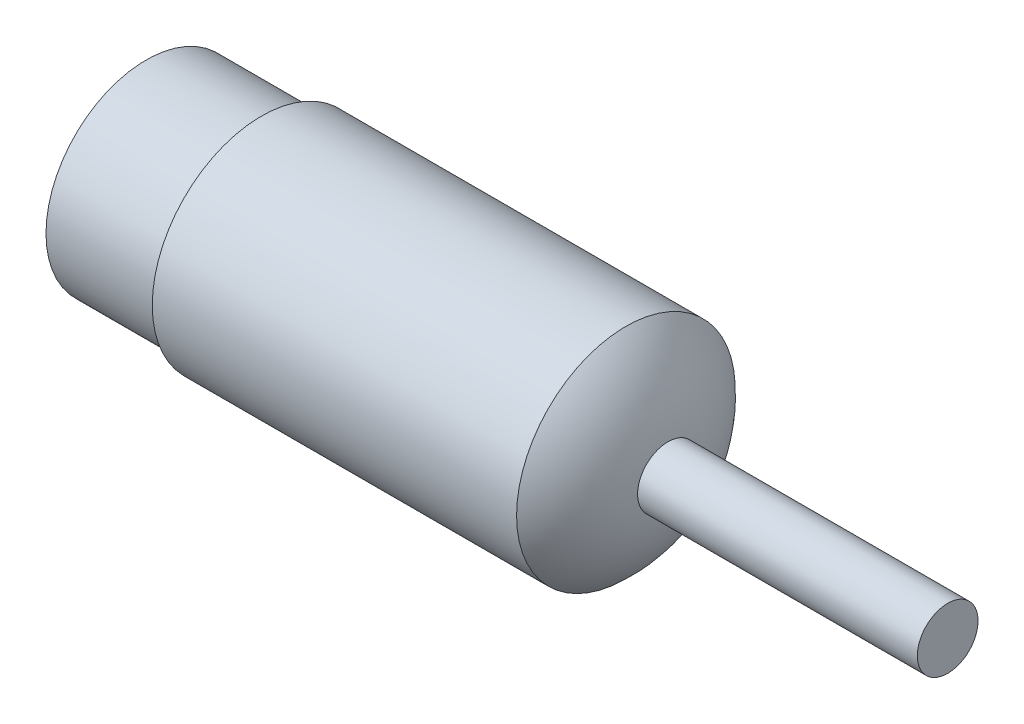
ISO-10303-21;
HEADER;
FILE_DESCRIPTION(('STEP AP214'),'2;1');
FILE_NAME('part.step','',(''),(''),'','','');
FILE_SCHEMA(('AUTOMOTIVE_DESIGN { 1 0 10303 214 1 1 1 1 }'));
ENDSEC;
DATA;
#1=APPLICATION_CONTEXT('core data for automotive mechanical design processes');
#2=APPLICATION_PROTOCOL_DEFINITION('international standard','automotive_design',2000,#1);
#3=PRODUCT_CONTEXT('',#1,'mechanical');
#4=PRODUCT('Part','Part','',(#3));
#5=PRODUCT_RELATED_PRODUCT_CATEGORY('part','',(#4));
#6=PRODUCT_DEFINITION_FORMATION('','',#4);
#7=PRODUCT_DEFINITION_CONTEXT('part definition',#1,'design');
#8=PRODUCT_DEFINITION('design','',#6,#7);
#9=PRODUCT_DEFINITION_SHAPE('','',#8);
#10=(LENGTH_UNIT() NAMED_UNIT(*) SI_UNIT(.MILLI.,.METRE.));
#11=(NAMED_UNIT(*) PLANE_ANGLE_UNIT() SI_UNIT($,.RADIAN.));
#12=(NAMED_UNIT(*) SI_UNIT($,.STERADIAN.) SOLID_ANGLE_UNIT());
#13=UNCERTAINTY_MEASURE_WITH_UNIT(LENGTH_MEASURE(1.E-05),#10,'distance_accuracy_value','');
#14=(GEOMETRIC_REPRESENTATION_CONTEXT(3) GLOBAL_UNCERTAINTY_ASSIGNED_CONTEXT((#13)) GLOBAL_UNIT_ASSIGNED_CONTEXT((#10,
#11,#12)) REPRESENTATION_CONTEXT('',''));
#15=CARTESIAN_POINT('',(0.,0.,0.));
#16=DIRECTION('',(0.,0.,1.));
#17=DIRECTION('',(1.,0.,0.));
#18=AXIS2_PLACEMENT_3D('',#15,#16,#17);
#19=CARTESIAN_POINT('',(0.,0.,0.));
#20=DIRECTION('',(1.,0.,0.));
#21=DIRECTION('',(0.,0.,-1.));
#22=AXIS2_PLACEMENT_3D('',#19,#20,#21);
#23=PLANE('',#22);
#24=CARTESIAN_POINT('',(0.,0.,0.));
#25=DIRECTION('',(-1.,0.,0.));
#26=DIRECTION('',(0.,0.,1.));
#27=AXIS2_PLACEMENT_3D('',#24,#25,#26);
#28=CIRCLE('',#27,8.25);
#29=CARTESIAN_POINT('',(0.,0.,8.25));
#30=VERTEX_POINT('',#29);
#31=EDGE_CURVE('E10',#30,#30,#28,.T.);
#32=ORIENTED_EDGE('',*,*,#31,.T.);
#33=EDGE_LOOP('',(#32));
#34=FACE_BOUND('',#33,.T.);
#35=ADVANCED_FACE('F32',(#34),#23,.F.);
#36=CARTESIAN_POINT('',(0.,0.,0.));
#37=DIRECTION('',(-1.,0.,0.));
#38=DIRECTION('',(0.,0.,1.));
#39=AXIS2_PLACEMENT_3D('',#36,#37,#38);
#40=CYLINDRICAL_SURFACE('',#39,8.25);
#41=ORIENTED_EDGE('',*,*,#31,.F.);
#42=EDGE_LOOP('',(#41));
#43=FACE_BOUND('',#42,.T.);
#44=CARTESIAN_POINT('',(9.5,0.,0.));
#45=DIRECTION('',(-1.,0.,0.));
#46=DIRECTION('',(0.,0.,1.));
#47=AXIS2_PLACEMENT_3D('',#44,#45,#46);
#48=CIRCLE('',#47,8.25);
#49=CARTESIAN_POINT('',(9.5,0.,8.25));
#50=VERTEX_POINT('',#49);
#51=EDGE_CURVE('E39',#50,#50,#48,.T.);
#52=ORIENTED_EDGE('',*,*,#51,.T.);
#53=EDGE_LOOP('',(#52));
#54=FACE_BOUND('',#53,.T.);
#55=ADVANCED_FACE('F74',(#43,#54),#40,.T.);
#56=CARTESIAN_POINT('',(9.5,8.25,0.));
#57=DIRECTION('',(1.,0.,0.));
#58=DIRECTION('',(0.,0.,-1.));
#59=AXIS2_PLACEMENT_3D('',#56,#57,#58);
#60=PLANE('',#59);
#61=ORIENTED_EDGE('',*,*,#51,.F.);
#62=EDGE_LOOP('',(#61));
#63=FACE_BOUND('',#62,.T.);
#64=CARTESIAN_POINT('',(9.5,0.,0.));
#65=DIRECTION('',(-1.,0.,0.));
#66=DIRECTION('',(0.,0.,1.));
#67=AXIS2_PLACEMENT_3D('',#64,#65,#66);
#68=CIRCLE('',#67,9.);
#69=CARTESIAN_POINT('',(9.5,0.,9.));
#70=VERTEX_POINT('',#69);
#71=EDGE_CURVE('E43',#70,#70,#68,.T.);
#72=ORIENTED_EDGE('',*,*,#71,.T.);
#73=EDGE_LOOP('',(#72));
#74=FACE_BOUND('',#73,.T.);
#75=ADVANCED_FACE('F78',(#63,#74),#60,.F.);
#76=CARTESIAN_POINT('',(0.,0.,0.));
#77=DIRECTION('',(-1.,0.,0.));
#78=DIRECTION('',(0.,0.,1.));
#79=AXIS2_PLACEMENT_3D('',#76,#77,#78);
#80=CYLINDRICAL_SURFACE('',#79,9.);
#81=ORIENTED_EDGE('',*,*,#71,.F.);
#82=EDGE_LOOP('',(#81));
#83=FACE_BOUND('',#82,.T.);
#84=CARTESIAN_POINT('',(39.5,0.,0.));
#85=DIRECTION('',(-1.,0.,0.));
#86=DIRECTION('',(0.,0.,1.));
#87=AXIS2_PLACEMENT_3D('',#84,#85,#86);
#88=CIRCLE('',#87,9.);
#89=CARTESIAN_POINT('',(39.5,0.,9.));
#90=VERTEX_POINT('',#89);
#91=EDGE_CURVE('E48',#90,#90,#88,.T.);
#92=ORIENTED_EDGE('',*,*,#91,.T.);
#93=EDGE_LOOP('',(#92));
#94=FACE_BOUND('',#93,.T.);
#95=ADVANCED_FACE('F71',(#83,#94),#80,.T.);
#96=CARTESIAN_POINT('',(32.491464953089,0.,0.));
#97=DIRECTION('',(-1.,0.,0.));
#98=DIRECTION('',(0.,0.,1.));
#99=AXIS2_PLACEMENT_3D('',#96,#97,#98);
#100=DEGENERATE_TOROIDAL_SURFACE('',#99,1.09390303731238,10.5653174437496,.T.);
#101=CARTESIAN_POINT('',(42.9627983934259,0.,0.));
#102=DIRECTION('',(-1.,0.,0.));
#103=DIRECTION('',(0.,0.,1.));
#104=AXIS2_PLACEMENT_3D('',#101,#102,#103);
#105=CIRCLE('',#104,2.5);
#106=CARTESIAN_POINT('',(42.9627983934259,0.,2.5));
#107=VERTEX_POINT('',#106);
#108=EDGE_CURVE('E35',#107,#107,#105,.T.);
#109=ORIENTED_EDGE('',*,*,#108,.T.);
#110=EDGE_LOOP('',(#109));
#111=FACE_BOUND('',#110,.T.);
#112=ORIENTED_EDGE('',*,*,#91,.F.);
#113=EDGE_LOOP('',(#112));
#114=FACE_BOUND('',#113,.T.);
#115=ADVANCED_FACE('F58',(#111,#114),#100,.T.);
#116=CARTESIAN_POINT('',(66.,0.,0.));
#117=DIRECTION('',(-1.,0.,0.));
#118=DIRECTION('',(0.,0.,1.));
#119=AXIS2_PLACEMENT_3D('',#116,#117,#118);
#120=CYLINDRICAL_SURFACE('',#119,2.5);
#121=CARTESIAN_POINT('',(66.,0.,0.));
#122=DIRECTION('',(-1.,0.,0.));
#123=DIRECTION('',(0.,0.,1.));
#124=AXIS2_PLACEMENT_3D('',#121,#122,#123);
#125=CIRCLE('',#124,2.5);
#126=CARTESIAN_POINT('',(66.,0.,2.5));
#127=VERTEX_POINT('',#126);
#128=EDGE_CURVE('E51',#127,#127,#125,.T.);
#129=ORIENTED_EDGE('',*,*,#128,.T.);
#130=EDGE_LOOP('',(#129));
#131=FACE_BOUND('',#130,.T.);
#132=ORIENTED_EDGE('',*,*,#108,.F.);
#133=EDGE_LOOP('',(#132));
#134=FACE_BOUND('',#133,.T.);
#135=ADVANCED_FACE('F61',(#131,#134),#120,.T.);
#136=CARTESIAN_POINT('',(66.,0.,0.));
#137=DIRECTION('',(-1.,0.,0.));
#138=DIRECTION('',(0.,0.,1.));
#139=AXIS2_PLACEMENT_3D('',#136,#137,#138);
#140=PLANE('',#139);
#141=ORIENTED_EDGE('',*,*,#128,.F.);
#142=EDGE_LOOP('',(#141));
#143=FACE_BOUND('',#142,.T.);
#144=ADVANCED_FACE('F63',(#143),#140,.F.);
#145=CLOSED_SHELL('',(#35,#55,#75,#95,#115,#135,#144));
#146=MANIFOLD_SOLID_BREP('B2',#145);
#147=ADVANCED_BREP_SHAPE_REPRESENTATION('',(#18,#146),#14);
#148=SHAPE_DEFINITION_REPRESENTATION(#9,#147);
ENDSEC;
END-ISO-10303-21;
